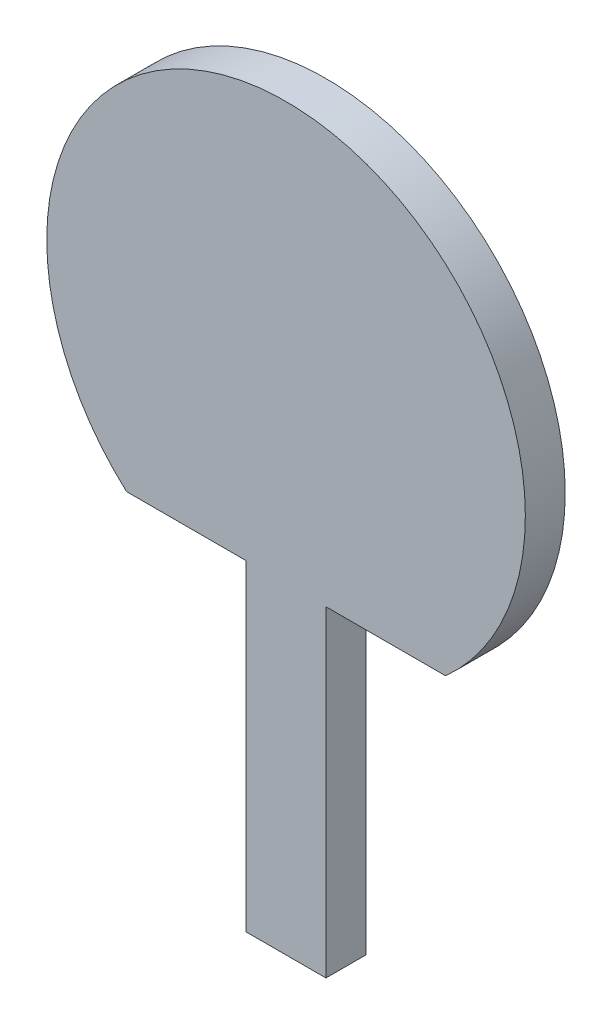
ISO-10303-21;
HEADER;
FILE_DESCRIPTION(('STEP AP214'),'2;1');
FILE_NAME('part.step','',(''),(''),'','','');
FILE_SCHEMA(('AUTOMOTIVE_DESIGN { 1 0 10303 214 1 1 1 1 }'));
ENDSEC;
DATA;
#1=APPLICATION_CONTEXT('core data for automotive mechanical design processes');
#2=APPLICATION_PROTOCOL_DEFINITION('international standard','automotive_design',2000,#1);
#3=PRODUCT_CONTEXT('',#1,'mechanical');
#4=PRODUCT('Part','Part','',(#3));
#5=PRODUCT_RELATED_PRODUCT_CATEGORY('part','',(#4));
#6=PRODUCT_DEFINITION_FORMATION('','',#4);
#7=PRODUCT_DEFINITION_CONTEXT('part definition',#1,'design');
#8=PRODUCT_DEFINITION('design','',#6,#7);
#9=PRODUCT_DEFINITION_SHAPE('','',#8);
#10=(LENGTH_UNIT() NAMED_UNIT(*) SI_UNIT(.MILLI.,.METRE.));
#11=(NAMED_UNIT(*) PLANE_ANGLE_UNIT() SI_UNIT($,.RADIAN.));
#12=(NAMED_UNIT(*) SI_UNIT($,.STERADIAN.) SOLID_ANGLE_UNIT());
#13=UNCERTAINTY_MEASURE_WITH_UNIT(LENGTH_MEASURE(1.E-05),#10,'distance_accuracy_value','');
#14=(GEOMETRIC_REPRESENTATION_CONTEXT(3) GLOBAL_UNCERTAINTY_ASSIGNED_CONTEXT((#13)) GLOBAL_UNIT_ASSIGNED_CONTEXT((#10,
#11,#12)) REPRESENTATION_CONTEXT('',''));
#15=CARTESIAN_POINT('',(0.,0.,0.));
#16=DIRECTION('',(0.,0.,1.));
#17=DIRECTION('',(1.,0.,0.));
#18=AXIS2_PLACEMENT_3D('',#15,#16,#17);
#19=CARTESIAN_POINT('',(0.,0.,10.));
#20=DIRECTION('',(0.,0.,-1.));
#21=DIRECTION('',(-1.,0.,0.));
#22=AXIS2_PLACEMENT_3D('',#19,#20,#21);
#23=CYLINDRICAL_SURFACE('',#22,60.);
#24=CARTESIAN_POINT('',(0.,0.,0.));
#25=DIRECTION('',(0.,0.,1.));
#26=DIRECTION('',(1.,0.,0.));
#27=AXIS2_PLACEMENT_3D('',#24,#25,#26);
#28=CIRCLE('',#27,60.);
#29=CARTESIAN_POINT('',(40.,-44.7213595499958,0.));
#30=VERTEX_POINT('',#29);
#31=CARTESIAN_POINT('',(-40.,-44.7213595499958,0.));
#32=VERTEX_POINT('',#31);
#33=EDGE_CURVE('E123',#30,#32,#28,.T.);
#34=ORIENTED_EDGE('',*,*,#33,.T.);
#35=DIRECTION('',(0.,0.,-1.));
#36=VECTOR('',#35,1.);
#37=CARTESIAN_POINT('',(-40.,-44.7213595499958,10.));
#38=LINE('',#37,#36);
#39=CARTESIAN_POINT('',(-40.,-44.7213595499958,10.));
#40=VERTEX_POINT('',#39);
#41=EDGE_CURVE('E11',#40,#32,#38,.T.);
#42=ORIENTED_EDGE('',*,*,#41,.F.);
#43=CARTESIAN_POINT('',(0.,0.,10.));
#44=DIRECTION('',(0.,0.,1.));
#45=DIRECTION('',(1.,0.,0.));
#46=AXIS2_PLACEMENT_3D('',#43,#44,#45);
#47=CIRCLE('',#46,60.);
#48=CARTESIAN_POINT('',(40.,-44.7213595499958,10.));
#49=VERTEX_POINT('',#48);
#50=EDGE_CURVE('E133',#49,#40,#47,.T.);
#51=ORIENTED_EDGE('',*,*,#50,.F.);
#52=DIRECTION('',(0.,0.,-1.));
#53=VECTOR('',#52,1.);
#54=CARTESIAN_POINT('',(40.,-44.7213595499958,10.));
#55=LINE('',#54,#53);
#56=EDGE_CURVE('E119',#49,#30,#55,.T.);
#57=ORIENTED_EDGE('',*,*,#56,.T.);
#58=EDGE_LOOP('',(#34,#42,#51,#57));
#59=FACE_BOUND('',#58,.T.);
#60=ADVANCED_FACE('F39',(#59),#23,.T.);
#61=CARTESIAN_POINT('',(-40.,-44.7213595499958,10.));
#62=DIRECTION('',(0.,1.,0.));
#63=DIRECTION('',(0.,0.,1.));
#64=AXIS2_PLACEMENT_3D('',#61,#62,#63);
#65=PLANE('',#64);
#66=DIRECTION('',(1.,0.,0.));
#67=VECTOR('',#66,1.);
#68=CARTESIAN_POINT('',(-40.,-44.7213595499958,0.));
#69=LINE('',#68,#67);
#70=CARTESIAN_POINT('',(-10.,-44.7213595499958,0.));
#71=VERTEX_POINT('',#70);
#72=EDGE_CURVE('E126',#32,#71,#69,.T.);
#73=ORIENTED_EDGE('',*,*,#72,.T.);
#74=DIRECTION('',(0.,0.,-1.));
#75=VECTOR('',#74,1.);
#76=CARTESIAN_POINT('',(-10.,-44.7213595499958,10.));
#77=LINE('',#76,#75);
#78=CARTESIAN_POINT('',(-10.,-44.7213595499958,10.));
#79=VERTEX_POINT('',#78);
#80=EDGE_CURVE('E47',#79,#71,#77,.T.);
#81=ORIENTED_EDGE('',*,*,#80,.F.);
#82=DIRECTION('',(1.,0.,0.));
#83=VECTOR('',#82,1.);
#84=CARTESIAN_POINT('',(-40.,-44.7213595499958,10.));
#85=LINE('',#84,#83);
#86=EDGE_CURVE('E92',#40,#79,#85,.T.);
#87=ORIENTED_EDGE('',*,*,#86,.F.);
#88=ORIENTED_EDGE('',*,*,#41,.T.);
#89=EDGE_LOOP('',(#73,#81,#87,#88));
#90=FACE_BOUND('',#89,.T.);
#91=ADVANCED_FACE('F157',(#90),#65,.F.);
#92=CARTESIAN_POINT('',(-10.,-125.340230382918,10.));
#93=DIRECTION('',(1.,0.,0.));
#94=DIRECTION('',(0.,0.,-1.));
#95=AXIS2_PLACEMENT_3D('',#92,#93,#94);
#96=PLANE('',#95);
#97=DIRECTION('',(0.,-1.,0.));
#98=VECTOR('',#97,1.);
#99=CARTESIAN_POINT('',(-10.,-125.340230382918,0.));
#100=LINE('',#99,#98);
#101=CARTESIAN_POINT('',(-10.,-125.340230382918,0.));
#102=VERTEX_POINT('',#101);
#103=EDGE_CURVE('E128',#71,#102,#100,.T.);
#104=ORIENTED_EDGE('',*,*,#103,.T.);
#105=DIRECTION('',(0.,0.,-1.));
#106=VECTOR('',#105,1.);
#107=CARTESIAN_POINT('',(-10.,-125.340230382918,10.));
#108=LINE('',#107,#106);
#109=CARTESIAN_POINT('',(-10.,-125.340230382918,10.));
#110=VERTEX_POINT('',#109);
#111=EDGE_CURVE('E114',#110,#102,#108,.T.);
#112=ORIENTED_EDGE('',*,*,#111,.F.);
#113=DIRECTION('',(0.,-1.,0.));
#114=VECTOR('',#113,1.);
#115=CARTESIAN_POINT('',(-10.,-125.340230382918,10.));
#116=LINE('',#115,#114);
#117=EDGE_CURVE('E105',#79,#110,#116,.T.);
#118=ORIENTED_EDGE('',*,*,#117,.F.);
#119=ORIENTED_EDGE('',*,*,#80,.T.);
#120=EDGE_LOOP('',(#104,#112,#118,#119));
#121=FACE_BOUND('',#120,.T.);
#122=ADVANCED_FACE('F139',(#121),#96,.F.);
#123=CARTESIAN_POINT('',(-10.,-125.340230382918,10.));
#124=DIRECTION('',(0.,1.,0.));
#125=DIRECTION('',(0.,0.,1.));
#126=AXIS2_PLACEMENT_3D('',#123,#124,#125);
#127=PLANE('',#126);
#128=DIRECTION('',(1.,0.,0.));
#129=VECTOR('',#128,1.);
#130=CARTESIAN_POINT('',(-10.,-125.340230382918,0.));
#131=LINE('',#130,#129);
#132=CARTESIAN_POINT('',(10.,-125.340230382918,0.));
#133=VERTEX_POINT('',#132);
#134=EDGE_CURVE('E113',#102,#133,#131,.T.);
#135=ORIENTED_EDGE('',*,*,#134,.T.);
#136=DIRECTION('',(0.,0.,-1.));
#137=VECTOR('',#136,1.);
#138=CARTESIAN_POINT('',(10.,-125.340230382918,10.));
#139=LINE('',#138,#137);
#140=CARTESIAN_POINT('',(10.,-125.340230382918,10.));
#141=VERTEX_POINT('',#140);
#142=EDGE_CURVE('E110',#141,#133,#139,.T.);
#143=ORIENTED_EDGE('',*,*,#142,.F.);
#144=DIRECTION('',(1.,0.,0.));
#145=VECTOR('',#144,1.);
#146=CARTESIAN_POINT('',(-10.,-125.340230382918,10.));
#147=LINE('',#146,#145);
#148=EDGE_CURVE('E99',#110,#141,#147,.T.);
#149=ORIENTED_EDGE('',*,*,#148,.F.);
#150=ORIENTED_EDGE('',*,*,#111,.T.);
#151=EDGE_LOOP('',(#135,#143,#149,#150));
#152=FACE_BOUND('',#151,.T.);
#153=ADVANCED_FACE('F111',(#152),#127,.F.);
#154=CARTESIAN_POINT('',(10.,-125.340230382918,10.));
#155=DIRECTION('',(-1.,0.,0.));
#156=DIRECTION('',(0.,0.,1.));
#157=AXIS2_PLACEMENT_3D('',#154,#155,#156);
#158=PLANE('',#157);
#159=DIRECTION('',(0.,1.,0.));
#160=VECTOR('',#159,1.);
#161=CARTESIAN_POINT('',(10.,-125.340230382918,0.));
#162=LINE('',#161,#160);
#163=CARTESIAN_POINT('',(10.,-44.7213595499958,0.));
#164=VERTEX_POINT('',#163);
#165=EDGE_CURVE('E78',#133,#164,#162,.T.);
#166=ORIENTED_EDGE('',*,*,#165,.T.);
#167=DIRECTION('',(0.,0.,-1.));
#168=VECTOR('',#167,1.);
#169=CARTESIAN_POINT('',(10.,-44.7213595499958,10.));
#170=LINE('',#169,#168);
#171=CARTESIAN_POINT('',(10.,-44.7213595499958,10.));
#172=VERTEX_POINT('',#171);
#173=EDGE_CURVE('E115',#172,#164,#170,.T.);
#174=ORIENTED_EDGE('',*,*,#173,.F.);
#175=DIRECTION('',(0.,1.,0.));
#176=VECTOR('',#175,1.);
#177=CARTESIAN_POINT('',(10.,-125.340230382918,10.));
#178=LINE('',#177,#176);
#179=EDGE_CURVE('E103',#141,#172,#178,.T.);
#180=ORIENTED_EDGE('',*,*,#179,.F.);
#181=ORIENTED_EDGE('',*,*,#142,.T.);
#182=EDGE_LOOP('',(#166,#174,#180,#181));
#183=FACE_BOUND('',#182,.T.);
#184=ADVANCED_FACE('F117',(#183),#158,.F.);
#185=CARTESIAN_POINT('',(10.,-44.7213595499958,10.));
#186=DIRECTION('',(0.,1.,0.));
#187=DIRECTION('',(0.,0.,1.));
#188=AXIS2_PLACEMENT_3D('',#185,#186,#187);
#189=PLANE('',#188);
#190=DIRECTION('',(1.,0.,0.));
#191=VECTOR('',#190,1.);
#192=CARTESIAN_POINT('',(10.,-44.7213595499958,0.));
#193=LINE('',#192,#191);
#194=EDGE_CURVE('E84',#164,#30,#193,.T.);
#195=ORIENTED_EDGE('',*,*,#194,.T.);
#196=ORIENTED_EDGE('',*,*,#56,.F.);
#197=DIRECTION('',(1.,0.,0.));
#198=VECTOR('',#197,1.);
#199=CARTESIAN_POINT('',(10.,-44.7213595499958,10.));
#200=LINE('',#199,#198);
#201=EDGE_CURVE('E55',#172,#49,#200,.T.);
#202=ORIENTED_EDGE('',*,*,#201,.F.);
#203=ORIENTED_EDGE('',*,*,#173,.T.);
#204=EDGE_LOOP('',(#195,#196,#202,#203));
#205=FACE_BOUND('',#204,.T.);
#206=ADVANCED_FACE('F146',(#205),#189,.F.);
#207=CARTESIAN_POINT('',(0.,0.,10.));
#208=DIRECTION('',(0.,0.,1.));
#209=DIRECTION('',(1.,0.,0.));
#210=AXIS2_PLACEMENT_3D('',#207,#208,#209);
#211=PLANE('',#210);
#212=ORIENTED_EDGE('',*,*,#50,.T.);
#213=ORIENTED_EDGE('',*,*,#86,.T.);
#214=ORIENTED_EDGE('',*,*,#117,.T.);
#215=ORIENTED_EDGE('',*,*,#148,.T.);
#216=ORIENTED_EDGE('',*,*,#179,.T.);
#217=ORIENTED_EDGE('',*,*,#201,.T.);
#218=EDGE_LOOP('',(#212,#213,#214,#215,#216,#217));
#219=FACE_BOUND('',#218,.T.);
#220=ADVANCED_FACE('F101',(#219),#211,.T.);
#221=CARTESIAN_POINT('',(0.,0.,0.));
#222=DIRECTION('',(0.,0.,1.));
#223=DIRECTION('',(1.,0.,0.));
#224=AXIS2_PLACEMENT_3D('',#221,#222,#223);
#225=PLANE('',#224);
#226=ORIENTED_EDGE('',*,*,#33,.F.);
#227=ORIENTED_EDGE('',*,*,#194,.F.);
#228=ORIENTED_EDGE('',*,*,#165,.F.);
#229=ORIENTED_EDGE('',*,*,#134,.F.);
#230=ORIENTED_EDGE('',*,*,#103,.F.);
#231=ORIENTED_EDGE('',*,*,#72,.F.);
#232=EDGE_LOOP('',(#226,#227,#228,#229,#230,#231));
#233=FACE_BOUND('',#232,.T.);
#234=ADVANCED_FACE('F142',(#233),#225,.F.);
#235=CLOSED_SHELL('',(#60,#91,#122,#153,#184,#206,#220,#234));
#236=MANIFOLD_SOLID_BREP('B2',#235);
#237=ADVANCED_BREP_SHAPE_REPRESENTATION('',(#18,#236),#14);
#238=SHAPE_DEFINITION_REPRESENTATION(#9,#237);
ENDSEC;
END-ISO-10303-21;
